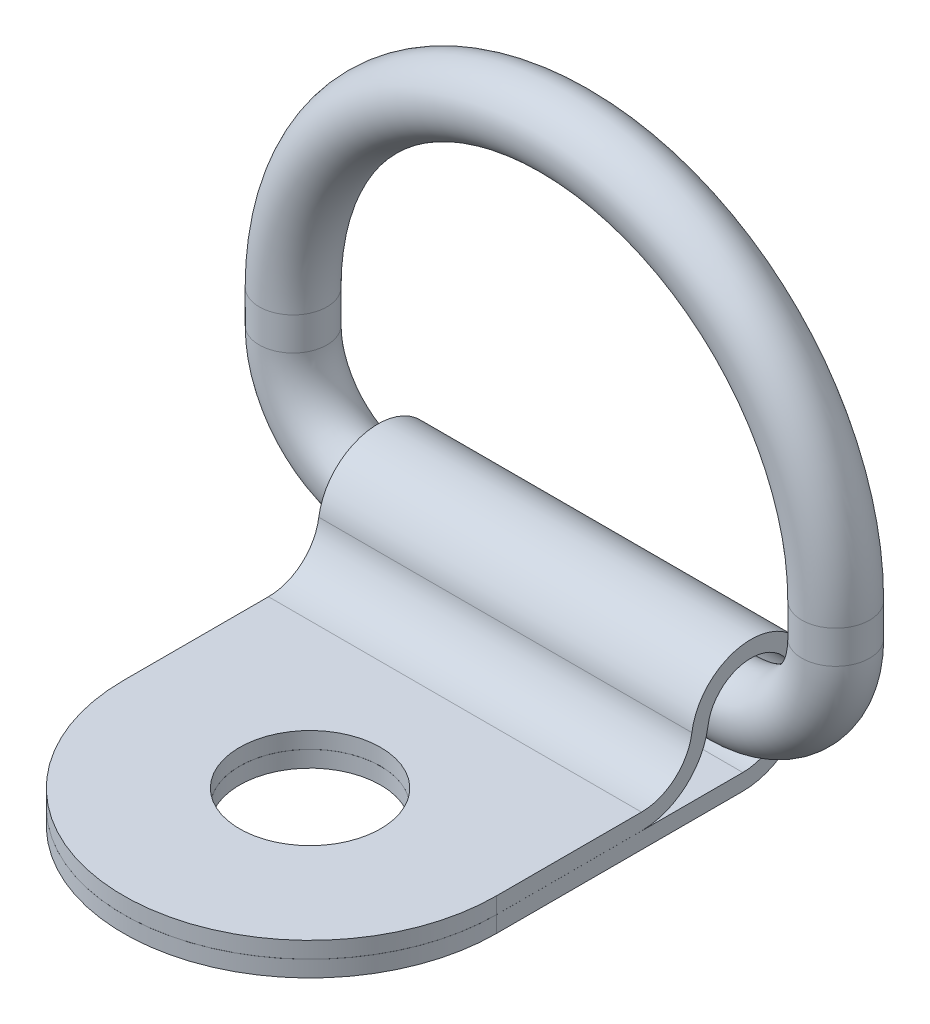
ISO-10303-21;
HEADER;
FILE_DESCRIPTION(('STEP AP214'),'2;1');
FILE_NAME('part.step','',(''),(''),'','','');
FILE_SCHEMA(('AUTOMOTIVE_DESIGN { 1 0 10303 214 1 1 1 1 }'));
ENDSEC;
DATA;
#1=APPLICATION_CONTEXT('core data for automotive mechanical design processes');
#2=APPLICATION_PROTOCOL_DEFINITION('international standard','automotive_design',2000,#1);
#3=PRODUCT_CONTEXT('',#1,'mechanical');
#4=PRODUCT('Part','Part','',(#3));
#5=PRODUCT_RELATED_PRODUCT_CATEGORY('part','',(#4));
#6=PRODUCT_DEFINITION_FORMATION('','',#4);
#7=PRODUCT_DEFINITION_CONTEXT('part definition',#1,'design');
#8=PRODUCT_DEFINITION('design','',#6,#7);
#9=PRODUCT_DEFINITION_SHAPE('','',#8);
#10=(LENGTH_UNIT() NAMED_UNIT(*) SI_UNIT(.MILLI.,.METRE.));
#11=(NAMED_UNIT(*) PLANE_ANGLE_UNIT() SI_UNIT($,.RADIAN.));
#12=(NAMED_UNIT(*) SI_UNIT($,.STERADIAN.) SOLID_ANGLE_UNIT());
#13=UNCERTAINTY_MEASURE_WITH_UNIT(LENGTH_MEASURE(1.E-05),#10,'distance_accuracy_value','');
#14=(GEOMETRIC_REPRESENTATION_CONTEXT(3) GLOBAL_UNCERTAINTY_ASSIGNED_CONTEXT((#13)) GLOBAL_UNIT_ASSIGNED_CONTEXT((#10,
#11,#12)) REPRESENTATION_CONTEXT('',''));
#15=CARTESIAN_POINT('',(0.,0.,0.));
#16=DIRECTION('',(0.,0.,1.));
#17=DIRECTION('',(1.,0.,0.));
#18=AXIS2_PLACEMENT_3D('',#15,#16,#17);
#19=CARTESIAN_POINT('',(8.73125,-3.175,20.6375));
#20=DIRECTION('',(0.,1.,0.));
#21=DIRECTION('',(0.,0.,1.));
#22=AXIS2_PLACEMENT_3D('',#19,#20,#21);
#23=PLANE('',#22);
#24=CARTESIAN_POINT('',(0.,-3.175,11.90625));
#25=DIRECTION('',(0.,-1.,0.));
#26=DIRECTION('',(0.,0.,-1.));
#27=AXIS2_PLACEMENT_3D('',#24,#25,#26);
#28=CIRCLE('',#27,3.302);
#29=CARTESIAN_POINT('',(0.,-3.175,8.60425));
#30=VERTEX_POINT('',#29);
#31=EDGE_CURVE('E267',#30,#30,#28,.T.);
#32=ORIENTED_EDGE('',*,*,#31,.F.);
#33=EDGE_LOOP('',(#32));
#34=FACE_BOUND('',#33,.T.);
#35=CARTESIAN_POINT('',(0.,-3.175,11.90625));
#36=DIRECTION('',(0.,1.,0.));
#37=DIRECTION('',(0.,0.,-1.));
#38=AXIS2_PLACEMENT_3D('',#35,#36,#37);
#39=CIRCLE('',#38,8.73125);
#40=CARTESIAN_POINT('',(-8.73125,-3.175,11.90625));
#41=VERTEX_POINT('',#40);
#42=CARTESIAN_POINT('',(8.73125,-3.175,11.90625));
#43=VERTEX_POINT('',#42);
#44=EDGE_CURVE('E128',#41,#43,#39,.T.);
#45=ORIENTED_EDGE('',*,*,#44,.F.);
#46=DIRECTION('',(0.,0.,-1.));
#47=VECTOR('',#46,1.);
#48=CARTESIAN_POINT('',(-8.73125,-3.175,20.6375));
#49=LINE('',#48,#47);
#50=CARTESIAN_POINT('',(-8.73125,-3.175,0.381));
#51=VERTEX_POINT('',#50);
#52=EDGE_CURVE('E176',#41,#51,#49,.T.);
#53=ORIENTED_EDGE('',*,*,#52,.T.);
#54=DIRECTION('',(-1.,0.,0.));
#55=VECTOR('',#54,1.);
#56=CARTESIAN_POINT('',(8.73125,-3.175,0.381));
#57=LINE('',#56,#55);
#58=CARTESIAN_POINT('',(8.73125,-3.175,0.381));
#59=VERTEX_POINT('',#58);
#60=EDGE_CURVE('E147',#59,#51,#57,.T.);
#61=ORIENTED_EDGE('',*,*,#60,.F.);
#62=DIRECTION('',(0.,0.,-1.));
#63=VECTOR('',#62,1.);
#64=CARTESIAN_POINT('',(8.73125,-3.175,20.6375));
#65=LINE('',#64,#63);
#66=EDGE_CURVE('E140',#43,#59,#65,.T.);
#67=ORIENTED_EDGE('',*,*,#66,.F.);
#68=EDGE_LOOP('',(#45,#53,#61,#67));
#69=FACE_BOUND('',#68,.T.);
#70=ADVANCED_FACE('F42',(#34,#69),#23,.F.);
#71=CARTESIAN_POINT('',(8.73125,0.,0.381));
#72=DIRECTION('',(-1.,0.,0.));
#73=DIRECTION('',(0.,0.,1.));
#74=AXIS2_PLACEMENT_3D('',#71,#72,#73);
#75=CYLINDRICAL_SURFACE('',#74,3.175);
#76=CARTESIAN_POINT('',(-8.73125,0.,0.381));
#77=DIRECTION('',(1.,0.,0.));
#78=DIRECTION('',(0.,0.,-1.));
#79=AXIS2_PLACEMENT_3D('',#76,#77,#78);
#80=CIRCLE('',#79,3.175);
#81=CARTESIAN_POINT('',(-8.73125,0.,-2.794));
#82=VERTEX_POINT('',#81);
#83=EDGE_CURVE('E178',#51,#82,#80,.T.);
#84=ORIENTED_EDGE('',*,*,#83,.T.);
#85=DIRECTION('',(-1.,0.,0.));
#86=VECTOR('',#85,1.);
#87=CARTESIAN_POINT('',(8.73125,0.,-2.794));
#88=LINE('',#87,#86);
#89=CARTESIAN_POINT('',(8.73125,0.,-2.794));
#90=VERTEX_POINT('',#89);
#91=EDGE_CURVE('E211',#90,#82,#88,.T.);
#92=ORIENTED_EDGE('',*,*,#91,.F.);
#93=CARTESIAN_POINT('',(8.73125,0.,0.381));
#94=DIRECTION('',(1.,0.,0.));
#95=DIRECTION('',(0.,0.,-1.));
#96=AXIS2_PLACEMENT_3D('',#93,#94,#95);
#97=CIRCLE('',#96,3.175);
#98=EDGE_CURVE('E149',#59,#90,#97,.T.);
#99=ORIENTED_EDGE('',*,*,#98,.F.);
#100=ORIENTED_EDGE('',*,*,#60,.T.);
#101=EDGE_LOOP('',(#84,#92,#99,#100));
#102=FACE_BOUND('',#101,.T.);
#103=ADVANCED_FACE('F236',(#102),#75,.T.);
#104=CARTESIAN_POINT('',(8.73125,0.,0.));
#105=DIRECTION('',(-1.,0.,0.));
#106=DIRECTION('',(0.,0.,1.));
#107=AXIS2_PLACEMENT_3D('',#104,#105,#106);
#108=CYLINDRICAL_SURFACE('',#107,2.794);
#109=CARTESIAN_POINT('',(-8.73125,0.,0.));
#110=DIRECTION('',(1.,0.,0.));
#111=DIRECTION('',(0.,0.,1.));
#112=AXIS2_PLACEMENT_3D('',#109,#110,#111);
#113=CIRCLE('',#112,2.794);
#114=CARTESIAN_POINT('',(-8.73125,0.395616687116565,2.76584949642509));
#115=VERTEX_POINT('',#114);
#116=EDGE_CURVE('E180',#82,#115,#113,.T.);
#117=ORIENTED_EDGE('',*,*,#116,.T.);
#118=DIRECTION('',(-1.,0.,0.));
#119=VECTOR('',#118,1.);
#120=CARTESIAN_POINT('',(8.73125,0.395616687116565,2.76584949642509));
#121=LINE('',#120,#119);
#122=CARTESIAN_POINT('',(8.73125,0.395616687116565,2.76584949642509));
#123=VERTEX_POINT('',#122);
#124=EDGE_CURVE('E208',#123,#115,#121,.T.);
#125=ORIENTED_EDGE('',*,*,#124,.F.);
#126=CARTESIAN_POINT('',(8.73125,0.,0.));
#127=DIRECTION('',(1.,0.,0.));
#128=DIRECTION('',(0.,0.,1.));
#129=AXIS2_PLACEMENT_3D('',#126,#127,#128);
#130=CIRCLE('',#129,2.794);
#131=EDGE_CURVE('E152',#90,#123,#130,.T.);
#132=ORIENTED_EDGE('',*,*,#131,.F.);
#133=ORIENTED_EDGE('',*,*,#91,.T.);
#134=EDGE_LOOP('',(#117,#125,#132,#133));
#135=FACE_BOUND('',#134,.T.);
#136=ADVANCED_FACE('F232',(#135),#108,.T.);
#137=CARTESIAN_POINT('',(8.73125,0.73279,5.1231075899692));
#138=DIRECTION('',(-1.,0.,0.));
#139=DIRECTION('',(0.,0.,1.));
#140=AXIS2_PLACEMENT_3D('',#137,#138,#139);
#141=CYLINDRICAL_SURFACE('',#140,2.38125);
#142=CARTESIAN_POINT('',(-8.73125,0.73279,5.1231075899692));
#143=DIRECTION('',(-1.,0.,0.));
#144=DIRECTION('',(0.,0.,1.));
#145=AXIS2_PLACEMENT_3D('',#142,#143,#144);
#146=CIRCLE('',#145,2.38125);
#147=CARTESIAN_POINT('',(-8.73125,-1.64846,5.1231075899692));
#148=VERTEX_POINT('',#147);
#149=EDGE_CURVE('E182',#115,#148,#146,.T.);
#150=ORIENTED_EDGE('',*,*,#149,.T.);
#151=DIRECTION('',(-1.,0.,0.));
#152=VECTOR('',#151,1.);
#153=CARTESIAN_POINT('',(8.73125,-1.64846,5.1231075899692));
#154=LINE('',#153,#152);
#155=CARTESIAN_POINT('',(8.73125,-1.64846,5.1231075899692));
#156=VERTEX_POINT('',#155);
#157=EDGE_CURVE('E205',#156,#148,#154,.T.);
#158=ORIENTED_EDGE('',*,*,#157,.F.);
#159=CARTESIAN_POINT('',(8.73125,0.73279,5.1231075899692));
#160=DIRECTION('',(-1.,0.,0.));
#161=DIRECTION('',(0.,0.,1.));
#162=AXIS2_PLACEMENT_3D('',#159,#160,#161);
#163=CIRCLE('',#162,2.38125);
#164=EDGE_CURVE('E161',#123,#156,#163,.T.);
#165=ORIENTED_EDGE('',*,*,#164,.F.);
#166=ORIENTED_EDGE('',*,*,#124,.T.);
#167=EDGE_LOOP('',(#150,#158,#165,#166));
#168=FACE_BOUND('',#167,.T.);
#169=ADVANCED_FACE('F227',(#168),#141,.F.);
#170=CARTESIAN_POINT('',(8.73125,-1.64846,20.6375));
#171=DIRECTION('',(0.,-1.,0.));
#172=DIRECTION('',(0.,0.,-1.));
#173=AXIS2_PLACEMENT_3D('',#170,#171,#172);
#174=PLANE('',#173);
#175=CARTESIAN_POINT('',(0.,-1.64846,11.90625));
#176=DIRECTION('',(0.,-1.,0.));
#177=DIRECTION('',(0.,0.,-1.));
#178=AXIS2_PLACEMENT_3D('',#175,#176,#177);
#179=CIRCLE('',#178,3.302);
#180=CARTESIAN_POINT('',(0.,-1.64846,8.60425));
#181=VERTEX_POINT('',#180);
#182=EDGE_CURVE('E135',#181,#181,#179,.T.);
#183=ORIENTED_EDGE('',*,*,#182,.T.);
#184=EDGE_LOOP('',(#183));
#185=FACE_BOUND('',#184,.T.);
#186=DIRECTION('',(0.,0.,1.));
#187=VECTOR('',#186,1.);
#188=CARTESIAN_POINT('',(-8.73125,-1.64846,20.6375));
#189=LINE('',#188,#187);
#190=CARTESIAN_POINT('',(-8.73125,-1.64846,11.90625));
#191=VERTEX_POINT('',#190);
#192=EDGE_CURVE('E184',#148,#191,#189,.T.);
#193=ORIENTED_EDGE('',*,*,#192,.T.);
#194=CARTESIAN_POINT('',(0.,-1.64846,11.90625));
#195=DIRECTION('',(0.,-1.,0.));
#196=DIRECTION('',(0.,0.,-1.));
#197=AXIS2_PLACEMENT_3D('',#194,#195,#196);
#198=CIRCLE('',#197,8.73125);
#199=CARTESIAN_POINT('',(8.73125,-1.64846,11.90625));
#200=VERTEX_POINT('',#199);
#201=EDGE_CURVE('E57',#191,#200,#198,.F.);
#202=ORIENTED_EDGE('',*,*,#201,.T.);
#203=DIRECTION('',(0.,0.,1.));
#204=VECTOR('',#203,1.);
#205=CARTESIAN_POINT('',(8.73125,-1.64846,20.6375));
#206=LINE('',#205,#204);
#207=EDGE_CURVE('E163',#156,#200,#206,.T.);
#208=ORIENTED_EDGE('',*,*,#207,.F.);
#209=ORIENTED_EDGE('',*,*,#157,.T.);
#210=EDGE_LOOP('',(#193,#202,#208,#209));
#211=FACE_BOUND('',#210,.T.);
#212=ADVANCED_FACE('F222',(#185,#211),#174,.F.);
#213=CARTESIAN_POINT('',(8.73125,-2.41046,20.6375));
#214=DIRECTION('',(0.,1.,0.));
#215=DIRECTION('',(0.,0.,1.));
#216=AXIS2_PLACEMENT_3D('',#213,#214,#215);
#217=PLANE('',#216);
#218=CARTESIAN_POINT('',(0.,-2.41046,11.90625));
#219=DIRECTION('',(0.,1.,0.));
#220=DIRECTION('',(0.,0.,1.));
#221=AXIS2_PLACEMENT_3D('',#218,#219,#220);
#222=CIRCLE('',#221,3.302);
#223=CARTESIAN_POINT('',(0.,-2.41046,15.20825));
#224=VERTEX_POINT('',#223);
#225=EDGE_CURVE('E264',#224,#224,#222,.T.);
#226=ORIENTED_EDGE('',*,*,#225,.T.);
#227=EDGE_LOOP('',(#226));
#228=FACE_BOUND('',#227,.T.);
#229=DIRECTION('',(0.,0.,-1.));
#230=VECTOR('',#229,1.);
#231=CARTESIAN_POINT('',(8.73125,-2.41046,20.6375));
#232=LINE('',#231,#230);
#233=CARTESIAN_POINT('',(8.73125,-2.41046,11.90625));
#234=VERTEX_POINT('',#233);
#235=CARTESIAN_POINT('',(8.73125,-2.41046,5.1231075899692));
#236=VERTEX_POINT('',#235);
#237=EDGE_CURVE('E166',#234,#236,#232,.T.);
#238=ORIENTED_EDGE('',*,*,#237,.F.);
#239=CARTESIAN_POINT('',(0.,-2.41046,11.90625));
#240=DIRECTION('',(0.,1.,0.));
#241=DIRECTION('',(0.,0.,1.));
#242=AXIS2_PLACEMENT_3D('',#239,#240,#241);
#243=CIRCLE('',#242,8.73125);
#244=CARTESIAN_POINT('',(-8.73125,-2.41046,11.90625));
#245=VERTEX_POINT('',#244);
#246=EDGE_CURVE('E242',#234,#245,#243,.F.);
#247=ORIENTED_EDGE('',*,*,#246,.T.);
#248=DIRECTION('',(0.,0.,-1.));
#249=VECTOR('',#248,1.);
#250=CARTESIAN_POINT('',(-8.73125,-2.41046,20.6375));
#251=LINE('',#250,#249);
#252=CARTESIAN_POINT('',(-8.73125,-2.41046,5.1231075899692));
#253=VERTEX_POINT('',#252);
#254=EDGE_CURVE('E187',#245,#253,#251,.T.);
#255=ORIENTED_EDGE('',*,*,#254,.T.);
#256=DIRECTION('',(-1.,0.,0.));
#257=VECTOR('',#256,1.);
#258=CARTESIAN_POINT('',(8.73125,-2.41046,5.1231075899692));
#259=LINE('',#258,#257);
#260=EDGE_CURVE('E202',#236,#253,#259,.T.);
#261=ORIENTED_EDGE('',*,*,#260,.F.);
#262=EDGE_LOOP('',(#238,#247,#255,#261));
#263=FACE_BOUND('',#262,.T.);
#264=ADVANCED_FACE('F241',(#228,#263),#217,.F.);
#265=CARTESIAN_POINT('',(8.73125,0.73279,5.1231075899692));
#266=DIRECTION('',(-1.,0.,0.));
#267=DIRECTION('',(0.,0.,1.));
#268=AXIS2_PLACEMENT_3D('',#265,#266,#267);
#269=CYLINDRICAL_SURFACE('',#268,3.14325);
#270=CARTESIAN_POINT('',(-8.73125,0.73279,5.1231075899692));
#271=DIRECTION('',(1.,0.,0.));
#272=DIRECTION('',(0.,0.,-1.));
#273=AXIS2_PLACEMENT_3D('',#270,#271,#272);
#274=CIRCLE('',#273,3.14325);
#275=CARTESIAN_POINT('',(-8.73125,0.287721226993863,2.01152690649097));
#276=VERTEX_POINT('',#275);
#277=EDGE_CURVE('E189',#253,#276,#274,.T.);
#278=ORIENTED_EDGE('',*,*,#277,.T.);
#279=DIRECTION('',(-1.,0.,0.));
#280=VECTOR('',#279,1.);
#281=CARTESIAN_POINT('',(8.73125,0.287721226993863,2.01152690649097));
#282=LINE('',#281,#280);
#283=CARTESIAN_POINT('',(8.73125,0.287721226993863,2.01152690649097));
#284=VERTEX_POINT('',#283);
#285=EDGE_CURVE('E199',#284,#276,#282,.T.);
#286=ORIENTED_EDGE('',*,*,#285,.F.);
#287=CARTESIAN_POINT('',(8.73125,0.73279,5.1231075899692));
#288=DIRECTION('',(1.,0.,0.));
#289=DIRECTION('',(0.,0.,-1.));
#290=AXIS2_PLACEMENT_3D('',#287,#288,#289);
#291=CIRCLE('',#290,3.14325);
#292=EDGE_CURVE('E168',#236,#284,#291,.T.);
#293=ORIENTED_EDGE('',*,*,#292,.F.);
#294=ORIENTED_EDGE('',*,*,#260,.T.);
#295=EDGE_LOOP('',(#278,#286,#293,#294));
#296=FACE_BOUND('',#295,.T.);
#297=ADVANCED_FACE('F246',(#296),#269,.T.);
#298=CARTESIAN_POINT('',(8.73125,0.,0.));
#299=DIRECTION('',(-1.,0.,0.));
#300=DIRECTION('',(0.,0.,1.));
#301=AXIS2_PLACEMENT_3D('',#298,#299,#300);
#302=CYLINDRICAL_SURFACE('',#301,2.032);
#303=CARTESIAN_POINT('',(-8.73125,0.,0.));
#304=DIRECTION('',(-1.,0.,0.));
#305=DIRECTION('',(0.,0.,1.));
#306=AXIS2_PLACEMENT_3D('',#303,#304,#305);
#307=CIRCLE('',#306,2.032);
#308=CARTESIAN_POINT('',(-8.73125,0.,-2.032));
#309=VERTEX_POINT('',#308);
#310=EDGE_CURVE('E191',#276,#309,#307,.T.);
#311=ORIENTED_EDGE('',*,*,#310,.T.);
#312=DIRECTION('',(-1.,0.,0.));
#313=VECTOR('',#312,1.);
#314=CARTESIAN_POINT('',(8.73125,0.,-2.032));
#315=LINE('',#314,#313);
#316=CARTESIAN_POINT('',(8.73125,0.,-2.032));
#317=VERTEX_POINT('',#316);
#318=EDGE_CURVE('E196',#317,#309,#315,.T.);
#319=ORIENTED_EDGE('',*,*,#318,.F.);
#320=CARTESIAN_POINT('',(8.73125,0.,0.));
#321=DIRECTION('',(-1.,0.,0.));
#322=DIRECTION('',(0.,0.,1.));
#323=AXIS2_PLACEMENT_3D('',#320,#321,#322);
#324=CIRCLE('',#323,2.032);
#325=EDGE_CURVE('E170',#284,#317,#324,.T.);
#326=ORIENTED_EDGE('',*,*,#325,.F.);
#327=ORIENTED_EDGE('',*,*,#285,.T.);
#328=EDGE_LOOP('',(#311,#319,#326,#327));
#329=FACE_BOUND('',#328,.T.);
#330=ADVANCED_FACE('F252',(#329),#302,.F.);
#331=CARTESIAN_POINT('',(8.73125,0.,0.381));
#332=DIRECTION('',(-1.,0.,0.));
#333=DIRECTION('',(0.,0.,1.));
#334=AXIS2_PLACEMENT_3D('',#331,#332,#333);
#335=CYLINDRICAL_SURFACE('',#334,2.413);
#336=CARTESIAN_POINT('',(-8.73125,0.,0.381));
#337=DIRECTION('',(-1.,0.,0.));
#338=DIRECTION('',(0.,0.,-1.));
#339=AXIS2_PLACEMENT_3D('',#336,#337,#338);
#340=CIRCLE('',#339,2.413);
#341=CARTESIAN_POINT('',(-8.73125,-2.413,0.381));
#342=VERTEX_POINT('',#341);
#343=EDGE_CURVE('E155',#309,#342,#340,.T.);
#344=ORIENTED_EDGE('',*,*,#343,.T.);
#345=DIRECTION('',(-1.,0.,0.));
#346=VECTOR('',#345,1.);
#347=CARTESIAN_POINT('',(8.73125,-2.413,0.381));
#348=LINE('',#347,#346);
#349=CARTESIAN_POINT('',(8.73125,-2.413,0.381));
#350=VERTEX_POINT('',#349);
#351=EDGE_CURVE('E175',#350,#342,#348,.T.);
#352=ORIENTED_EDGE('',*,*,#351,.F.);
#353=CARTESIAN_POINT('',(8.73125,0.,0.381));
#354=DIRECTION('',(-1.,0.,0.));
#355=DIRECTION('',(0.,0.,-1.));
#356=AXIS2_PLACEMENT_3D('',#353,#354,#355);
#357=CIRCLE('',#356,2.413);
#358=EDGE_CURVE('E172',#317,#350,#357,.T.);
#359=ORIENTED_EDGE('',*,*,#358,.F.);
#360=ORIENTED_EDGE('',*,*,#318,.T.);
#361=EDGE_LOOP('',(#344,#352,#359,#360));
#362=FACE_BOUND('',#361,.T.);
#363=ADVANCED_FACE('F256',(#362),#335,.F.);
#364=CARTESIAN_POINT('',(8.73125,-2.413,20.6375));
#365=DIRECTION('',(0.,-1.,0.));
#366=DIRECTION('',(0.,0.,-1.));
#367=AXIS2_PLACEMENT_3D('',#364,#365,#366);
#368=PLANE('',#367);
#369=CARTESIAN_POINT('',(0.,-2.413,11.90625));
#370=DIRECTION('',(0.,-1.,0.));
#371=DIRECTION('',(0.,0.,-1.));
#372=AXIS2_PLACEMENT_3D('',#369,#370,#371);
#373=CIRCLE('',#372,3.302);
#374=CARTESIAN_POINT('',(0.,-2.413,8.60425));
#375=VERTEX_POINT('',#374);
#376=EDGE_CURVE('E45',#375,#375,#373,.T.);
#377=ORIENTED_EDGE('',*,*,#376,.T.);
#378=EDGE_LOOP('',(#377));
#379=FACE_BOUND('',#378,.T.);
#380=DIRECTION('',(0.,0.,1.));
#381=VECTOR('',#380,1.);
#382=CARTESIAN_POINT('',(-8.73125,-2.413,20.6375));
#383=LINE('',#382,#381);
#384=CARTESIAN_POINT('',(-8.73125,-2.413,11.90625));
#385=VERTEX_POINT('',#384);
#386=EDGE_CURVE('E150',#342,#385,#383,.T.);
#387=ORIENTED_EDGE('',*,*,#386,.T.);
#388=CARTESIAN_POINT('',(0.,-2.413,11.90625));
#389=DIRECTION('',(0.,-1.,0.));
#390=DIRECTION('',(0.,0.,-1.));
#391=AXIS2_PLACEMENT_3D('',#388,#389,#390);
#392=CIRCLE('',#391,8.73125);
#393=CARTESIAN_POINT('',(8.73125,-2.413,11.90625));
#394=VERTEX_POINT('',#393);
#395=EDGE_CURVE('E65',#385,#394,#392,.F.);
#396=ORIENTED_EDGE('',*,*,#395,.T.);
#397=DIRECTION('',(0.,0.,1.));
#398=VECTOR('',#397,1.);
#399=CARTESIAN_POINT('',(8.73125,-2.413,20.6375));
#400=LINE('',#399,#398);
#401=EDGE_CURVE('E143',#350,#394,#400,.T.);
#402=ORIENTED_EDGE('',*,*,#401,.F.);
#403=ORIENTED_EDGE('',*,*,#351,.T.);
#404=EDGE_LOOP('',(#387,#396,#402,#403));
#405=FACE_BOUND('',#404,.T.);
#406=ADVANCED_FACE('F259',(#379,#405),#368,.F.);
#407=CARTESIAN_POINT('',(8.73125,0.,0.381));
#408=DIRECTION('',(1.,0.,0.));
#409=DIRECTION('',(0.,0.,-1.));
#410=AXIS2_PLACEMENT_3D('',#407,#408,#409);
#411=PLANE('',#410);
#412=DIRECTION('',(0.,-1.,0.));
#413=VECTOR('',#412,1.);
#414=CARTESIAN_POINT('',(8.73125,20.6375,11.90625));
#415=LINE('',#414,#413);
#416=EDGE_CURVE('E131',#394,#43,#415,.T.);
#417=ORIENTED_EDGE('',*,*,#416,.T.);
#418=ORIENTED_EDGE('',*,*,#66,.T.);
#419=ORIENTED_EDGE('',*,*,#98,.T.);
#420=ORIENTED_EDGE('',*,*,#131,.T.);
#421=ORIENTED_EDGE('',*,*,#164,.T.);
#422=ORIENTED_EDGE('',*,*,#207,.T.);
#423=EDGE_CURVE('E144',#200,#234,#415,.T.);
#424=ORIENTED_EDGE('',*,*,#423,.T.);
#425=ORIENTED_EDGE('',*,*,#237,.T.);
#426=ORIENTED_EDGE('',*,*,#292,.T.);
#427=ORIENTED_EDGE('',*,*,#325,.T.);
#428=ORIENTED_EDGE('',*,*,#358,.T.);
#429=ORIENTED_EDGE('',*,*,#401,.T.);
#430=EDGE_LOOP('',(#417,#418,#419,#420,#421,#422,#424,#425,#426,#427,#428,#429));
#431=FACE_BOUND('',#430,.T.);
#432=ADVANCED_FACE('F139',(#431),#411,.T.);
#433=CARTESIAN_POINT('',(-8.73125,0.,0.381));
#434=DIRECTION('',(1.,0.,0.));
#435=DIRECTION('',(0.,0.,-1.));
#436=AXIS2_PLACEMENT_3D('',#433,#434,#435);
#437=PLANE('',#436);
#438=ORIENTED_EDGE('',*,*,#52,.F.);
#439=DIRECTION('',(0.,-1.,0.));
#440=VECTOR('',#439,1.);
#441=CARTESIAN_POINT('',(-8.73125,20.6375,11.90625));
#442=LINE('',#441,#440);
#443=EDGE_CURVE('E12',#41,#385,#442,.F.);
#444=ORIENTED_EDGE('',*,*,#443,.T.);
#445=ORIENTED_EDGE('',*,*,#386,.F.);
#446=ORIENTED_EDGE('',*,*,#343,.F.);
#447=ORIENTED_EDGE('',*,*,#310,.F.);
#448=ORIENTED_EDGE('',*,*,#277,.F.);
#449=ORIENTED_EDGE('',*,*,#254,.F.);
#450=EDGE_CURVE('E50',#245,#191,#442,.F.);
#451=ORIENTED_EDGE('',*,*,#450,.T.);
#452=ORIENTED_EDGE('',*,*,#192,.F.);
#453=ORIENTED_EDGE('',*,*,#149,.F.);
#454=ORIENTED_EDGE('',*,*,#116,.F.);
#455=ORIENTED_EDGE('',*,*,#83,.F.);
#456=EDGE_LOOP('',(#438,#444,#445,#446,#447,#448,#449,#451,#452,#453,#454,#455));
#457=FACE_BOUND('',#456,.T.);
#458=ADVANCED_FACE('F217',(#457),#437,.F.);
#459=CARTESIAN_POINT('',(0.,20.6375,11.90625));
#460=DIRECTION('',(0.,-1.,0.));
#461=DIRECTION('',(0.,0.,-1.));
#462=AXIS2_PLACEMENT_3D('',#459,#460,#461);
#463=CYLINDRICAL_SURFACE('',#462,8.73125);
#464=ORIENTED_EDGE('',*,*,#450,.F.);
#465=ORIENTED_EDGE('',*,*,#246,.F.);
#466=ORIENTED_EDGE('',*,*,#423,.F.);
#467=ORIENTED_EDGE('',*,*,#201,.F.);
#468=EDGE_LOOP('',(#464,#465,#466,#467));
#469=FACE_BOUND('',#468,.T.);
#470=ADVANCED_FACE('F284',(#469),#463,.T.);
#471=ORIENTED_EDGE('',*,*,#44,.T.);
#472=ORIENTED_EDGE('',*,*,#416,.F.);
#473=ORIENTED_EDGE('',*,*,#395,.F.);
#474=ORIENTED_EDGE('',*,*,#443,.F.);
#475=EDGE_LOOP('',(#471,#472,#473,#474));
#476=FACE_BOUND('',#475,.T.);
#477=ADVANCED_FACE('F130',(#476),#463,.T.);
#478=CARTESIAN_POINT('',(0.,20.6375,11.90625));
#479=DIRECTION('',(0.,-1.,0.));
#480=DIRECTION('',(0.,0.,-1.));
#481=AXIS2_PLACEMENT_3D('',#478,#479,#480);
#482=CYLINDRICAL_SURFACE('',#481,3.302);
#483=ORIENTED_EDGE('',*,*,#31,.T.);
#484=EDGE_LOOP('',(#483));
#485=FACE_BOUND('',#484,.T.);
#486=ORIENTED_EDGE('',*,*,#376,.F.);
#487=EDGE_LOOP('',(#486));
#488=FACE_BOUND('',#487,.T.);
#489=ADVANCED_FACE('F275',(#485,#488),#482,.F.);
#490=ORIENTED_EDGE('',*,*,#225,.F.);
#491=EDGE_LOOP('',(#490));
#492=FACE_BOUND('',#491,.T.);
#493=ORIENTED_EDGE('',*,*,#182,.F.);
#494=EDGE_LOOP('',(#493));
#495=FACE_BOUND('',#494,.T.);
#496=ADVANCED_FACE('F277',(#492,#495),#482,.F.);
#497=CLOSED_SHELL('',(#70,#103,#136,#169,#212,#264,#297,#330,#363,#406,#432,#458,#470,#477,#489,#496));
#498=MANIFOLD_SOLID_BREP('B2',#497);
#499=CARTESIAN_POINT('',(7.89409875810043,4.80590124189957,0.));
#500=DIRECTION('',(0.,0.,-1.));
#501=DIRECTION('',(-1.,0.,0.));
#502=AXIS2_PLACEMENT_3D('',#499,#500,#501);
#503=TOROIDAL_SURFACE('',#502,4.80590124189957,1.5875);
#504=CARTESIAN_POINT('',(12.7,4.80590124189957,0.));
#505=DIRECTION('',(0.,1.,0.));
#506=DIRECTION('',(0.,0.,-1.));
#507=AXIS2_PLACEMENT_3D('',#504,#505,#506);
#508=CIRCLE('',#507,1.5875);
#509=CARTESIAN_POINT('',(14.2875,4.80590124189958,0.));
#510=VERTEX_POINT('',#509);
#511=EDGE_CURVE('E417',#510,#510,#508,.T.);
#512=CARTESIAN_POINT('',(7.89409875810044,0.,0.));
#513=DIRECTION('',(1.,0.,0.));
#514=DIRECTION('',(0.,0.,-1.));
#515=AXIS2_PLACEMENT_3D('',#512,#513,#514);
#516=CIRCLE('',#515,1.5875);
#517=CARTESIAN_POINT('',(7.89409875810044,-1.5875,0.));
#518=VERTEX_POINT('',#517);
#519=EDGE_CURVE('E41',#518,#518,#516,.T.);
#520=CARTESIAN_POINT('',(7.89409875810043,4.80590124189957,0.));
#521=DIRECTION('',(0.,0.,-1.));
#522=DIRECTION('',(-1.,0.,0.));
#523=AXIS2_PLACEMENT_3D('',#520,#521,#522);
#524=CIRCLE('',#523,6.39340124189957);
#525=EDGE_CURVE('',#510,#518,#524,.T.);
#526=ORIENTED_EDGE('',*,*,#511,.F.);
#527=ORIENTED_EDGE('',*,*,#519,.T.);
#528=ORIENTED_EDGE('',*,*,#525,.T.);
#529=ORIENTED_EDGE('',*,*,#525,.F.);
#530=EDGE_LOOP('',(#526,#528,#527,#529));
#531=FACE_BOUND('',#530,.T.);
#532=ADVANCED_FACE('F411',(#531),#503,.T.);
#533=CARTESIAN_POINT('',(12.7,6.35,0.));
#534=DIRECTION('',(0.,-1.,0.));
#535=DIRECTION('',(1.,0.,0.));
#536=AXIS2_PLACEMENT_3D('',#533,#534,#535);
#537=CYLINDRICAL_SURFACE('',#536,1.5875);
#538=CARTESIAN_POINT('',(12.7,6.35,0.));
#539=DIRECTION('',(0.,1.,0.));
#540=DIRECTION('',(0.,0.,-1.));
#541=AXIS2_PLACEMENT_3D('',#538,#539,#540);
#542=CIRCLE('',#541,1.5875);
#543=CARTESIAN_POINT('',(14.2875,6.35,0.));
#544=VERTEX_POINT('',#543);
#545=EDGE_CURVE('E421',#544,#544,#542,.T.);
#546=ORIENTED_EDGE('',*,*,#545,.F.);
#547=EDGE_LOOP('',(#546));
#548=FACE_BOUND('',#547,.T.);
#549=ORIENTED_EDGE('',*,*,#511,.T.);
#550=EDGE_LOOP('',(#549));
#551=FACE_BOUND('',#550,.T.);
#552=ADVANCED_FACE('F455',(#548,#551),#537,.T.);
#553=CARTESIAN_POINT('',(0.,6.35,0.));
#554=DIRECTION('',(0.,0.,-1.));
#555=DIRECTION('',(-1.,0.,0.));
#556=AXIS2_PLACEMENT_3D('',#553,#554,#555);
#557=TOROIDAL_SURFACE('',#556,12.7,1.5875);
#558=CARTESIAN_POINT('',(-12.7,6.34999999999999,0.));
#559=DIRECTION('',(0.,-1.,0.));
#560=DIRECTION('',(0.,0.,-1.));
#561=AXIS2_PLACEMENT_3D('',#558,#559,#560);
#562=CIRCLE('',#561,1.5875);
#563=CARTESIAN_POINT('',(-14.2875,6.34999999999999,0.));
#564=VERTEX_POINT('',#563);
#565=EDGE_CURVE('E425',#564,#564,#562,.T.);
#566=CARTESIAN_POINT('',(0.,6.35,0.));
#567=DIRECTION('',(0.,0.,-1.));
#568=DIRECTION('',(-1.,0.,0.));
#569=AXIS2_PLACEMENT_3D('',#566,#567,#568);
#570=CIRCLE('',#569,14.2875);
#571=EDGE_CURVE('',#564,#544,#570,.T.);
#572=ORIENTED_EDGE('',*,*,#565,.F.);
#573=ORIENTED_EDGE('',*,*,#545,.T.);
#574=ORIENTED_EDGE('',*,*,#571,.T.);
#575=ORIENTED_EDGE('',*,*,#571,.F.);
#576=EDGE_LOOP('',(#572,#574,#573,#575));
#577=FACE_BOUND('',#576,.T.);
#578=ADVANCED_FACE('F449',(#577),#557,.T.);
#579=CARTESIAN_POINT('',(-12.7,4.80590124189956,0.));
#580=DIRECTION('',(0.,1.,0.));
#581=DIRECTION('',(-1.,0.,0.));
#582=AXIS2_PLACEMENT_3D('',#579,#580,#581);
#583=CYLINDRICAL_SURFACE('',#582,1.5875);
#584=CARTESIAN_POINT('',(-12.7,4.80590124189956,0.));
#585=DIRECTION('',(0.,-1.,0.));
#586=DIRECTION('',(0.,0.,-1.));
#587=AXIS2_PLACEMENT_3D('',#584,#585,#586);
#588=CIRCLE('',#587,1.5875);
#589=CARTESIAN_POINT('',(-14.2875,4.80590124189956,0.));
#590=VERTEX_POINT('',#589);
#591=EDGE_CURVE('E430',#590,#590,#588,.T.);
#592=ORIENTED_EDGE('',*,*,#591,.F.);
#593=EDGE_LOOP('',(#592));
#594=FACE_BOUND('',#593,.T.);
#595=ORIENTED_EDGE('',*,*,#565,.T.);
#596=EDGE_LOOP('',(#595));
#597=FACE_BOUND('',#596,.T.);
#598=ADVANCED_FACE('F443',(#594,#597),#583,.T.);
#599=CARTESIAN_POINT('',(-7.89409875810043,4.80590124189957,0.));
#600=DIRECTION('',(0.,0.,-1.));
#601=DIRECTION('',(-1.,0.,0.));
#602=AXIS2_PLACEMENT_3D('',#599,#600,#601);
#603=TOROIDAL_SURFACE('',#602,4.80590124189957,1.5875);
#604=CARTESIAN_POINT('',(-7.89409875810043,0.,0.));
#605=DIRECTION('',(1.,0.,0.));
#606=DIRECTION('',(0.,0.,-1.));
#607=AXIS2_PLACEMENT_3D('',#604,#605,#606);
#608=CIRCLE('',#607,1.5875);
#609=CARTESIAN_POINT('',(-7.89409875810043,-1.5875,0.));
#610=VERTEX_POINT('',#609);
#611=EDGE_CURVE('E433',#610,#610,#608,.T.);
#612=CARTESIAN_POINT('',(-7.89409875810043,4.80590124189957,0.));
#613=DIRECTION('',(0.,0.,-1.));
#614=DIRECTION('',(-1.,0.,0.));
#615=AXIS2_PLACEMENT_3D('',#612,#613,#614);
#616=CIRCLE('',#615,6.39340124189957);
#617=EDGE_CURVE('',#610,#590,#616,.T.);
#618=ORIENTED_EDGE('',*,*,#611,.F.);
#619=ORIENTED_EDGE('',*,*,#591,.T.);
#620=ORIENTED_EDGE('',*,*,#617,.T.);
#621=ORIENTED_EDGE('',*,*,#617,.F.);
#622=EDGE_LOOP('',(#618,#620,#619,#621));
#623=FACE_BOUND('',#622,.T.);
#624=ADVANCED_FACE('F440',(#623),#603,.T.);
#625=CARTESIAN_POINT('',(-7.89409875810043,0.,0.));
#626=DIRECTION('',(1.,0.,0.));
#627=DIRECTION('',(0.,0.,-1.));
#628=AXIS2_PLACEMENT_3D('',#625,#626,#627);
#629=CYLINDRICAL_SURFACE('',#628,1.5875);
#630=ORIENTED_EDGE('',*,*,#611,.T.);
#631=EDGE_LOOP('',(#630));
#632=FACE_BOUND('',#631,.T.);
#633=ORIENTED_EDGE('',*,*,#519,.F.);
#634=EDGE_LOOP('',(#633));
#635=FACE_BOUND('',#634,.T.);
#636=ADVANCED_FACE('F437',(#632,#635),#629,.T.);
#637=CLOSED_SHELL('',(#532,#552,#578,#598,#624,#636));
#638=MANIFOLD_SOLID_BREP('B6',#637);
#639=ADVANCED_BREP_SHAPE_REPRESENTATION('',(#18,#498,#638),#14);
#640=SHAPE_DEFINITION_REPRESENTATION(#9,#639);
ENDSEC;
END-ISO-10303-21;
